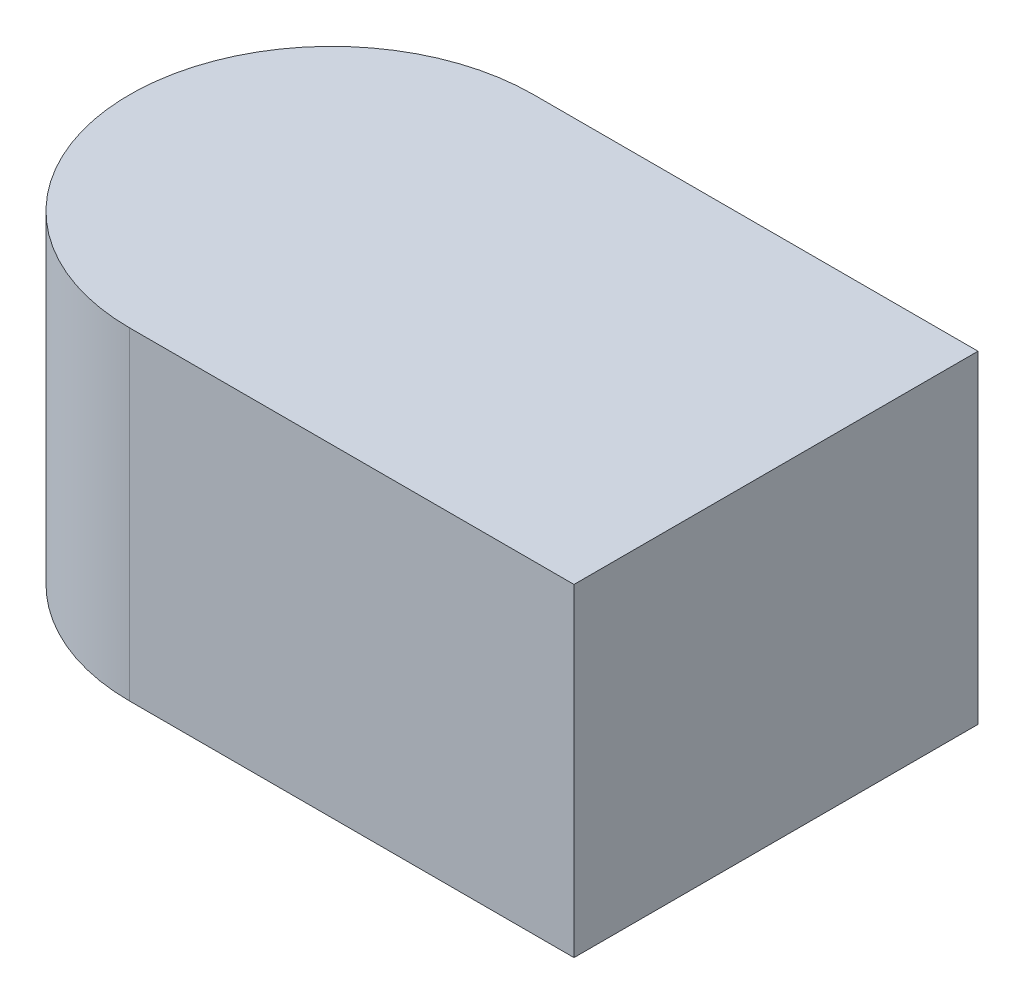
ISO-10303-21;
HEADER;
FILE_DESCRIPTION(('STEP AP214'),'2;1');
FILE_NAME('part.step','',(''),(''),'','','');
FILE_SCHEMA(('AUTOMOTIVE_DESIGN { 1 0 10303 214 1 1 1 1 }'));
ENDSEC;
DATA;
#1=APPLICATION_CONTEXT('core data for automotive mechanical design processes');
#2=APPLICATION_PROTOCOL_DEFINITION('international standard','automotive_design',2000,#1);
#3=PRODUCT_CONTEXT('',#1,'mechanical');
#4=PRODUCT('Part','Part','',(#3));
#5=PRODUCT_RELATED_PRODUCT_CATEGORY('part','',(#4));
#6=PRODUCT_DEFINITION_FORMATION('','',#4);
#7=PRODUCT_DEFINITION_CONTEXT('part definition',#1,'design');
#8=PRODUCT_DEFINITION('design','',#6,#7);
#9=PRODUCT_DEFINITION_SHAPE('','',#8);
#10=(LENGTH_UNIT() NAMED_UNIT(*) SI_UNIT(.MILLI.,.METRE.));
#11=(NAMED_UNIT(*) PLANE_ANGLE_UNIT() SI_UNIT($,.RADIAN.));
#12=(NAMED_UNIT(*) SI_UNIT($,.STERADIAN.) SOLID_ANGLE_UNIT());
#13=UNCERTAINTY_MEASURE_WITH_UNIT(LENGTH_MEASURE(1.E-05),#10,'distance_accuracy_value','');
#14=(GEOMETRIC_REPRESENTATION_CONTEXT(3) GLOBAL_UNCERTAINTY_ASSIGNED_CONTEXT((#13)) GLOBAL_UNIT_ASSIGNED_CONTEXT((#10,
#11,#12)) REPRESENTATION_CONTEXT('',''));
#15=CARTESIAN_POINT('',(0.,0.,0.));
#16=DIRECTION('',(0.,0.,1.));
#17=DIRECTION('',(1.,0.,0.));
#18=AXIS2_PLACEMENT_3D('',#15,#16,#17);
#19=CARTESIAN_POINT('',(0.,0.,0.));
#20=DIRECTION('',(0.,1.,0.));
#21=DIRECTION('',(1.,0.,0.));
#22=AXIS2_PLACEMENT_3D('',#19,#20,#21);
#23=PLANE('',#22);
#24=DIRECTION('',(0.,0.,-1.));
#25=VECTOR('',#24,1.);
#26=CARTESIAN_POINT('',(1.5,0.,0.375));
#27=LINE('',#26,#25);
#28=CARTESIAN_POINT('',(1.5,0.,0.375));
#29=VERTEX_POINT('',#28);
#30=CARTESIAN_POINT('',(1.5,0.,0.125));
#31=VERTEX_POINT('',#30);
#32=EDGE_CURVE('E11',#29,#31,#27,.T.);
#33=ORIENTED_EDGE('',*,*,#32,.F.);
#34=DIRECTION('',(1.,0.,0.));
#35=VECTOR('',#34,1.);
#36=CARTESIAN_POINT('',(1.225,0.,0.375));
#37=LINE('',#36,#35);
#38=CARTESIAN_POINT('',(1.225,0.,0.375));
#39=VERTEX_POINT('',#38);
#40=EDGE_CURVE('E24',#39,#29,#37,.T.);
#41=ORIENTED_EDGE('',*,*,#40,.F.);
#42=CARTESIAN_POINT('',(1.225,0.,0.25));
#43=DIRECTION('',(0.,1.,0.));
#44=DIRECTION('',(0.,0.,-1.));
#45=AXIS2_PLACEMENT_3D('',#42,#43,#44);
#46=CIRCLE('',#45,0.125);
#47=CARTESIAN_POINT('',(1.225,0.,0.125));
#48=VERTEX_POINT('',#47);
#49=EDGE_CURVE('E61',#48,#39,#46,.T.);
#50=ORIENTED_EDGE('',*,*,#49,.F.);
#51=DIRECTION('',(-1.,0.,0.));
#52=VECTOR('',#51,1.);
#53=CARTESIAN_POINT('',(1.5,0.,0.125));
#54=LINE('',#53,#52);
#55=EDGE_CURVE('E37',#31,#48,#54,.T.);
#56=ORIENTED_EDGE('',*,*,#55,.F.);
#57=EDGE_LOOP('',(#33,#41,#50,#56));
#58=FACE_BOUND('',#57,.T.);
#59=ADVANCED_FACE('F17',(#58),#23,.F.);
#60=CARTESIAN_POINT('',(1.5,0.,0.125));
#61=DIRECTION('',(0.,0.,-1.));
#62=DIRECTION('',(-1.,0.,0.));
#63=AXIS2_PLACEMENT_3D('',#60,#61,#62);
#64=PLANE('',#63);
#65=DIRECTION('',(0.,1.,0.));
#66=VECTOR('',#65,1.);
#67=CARTESIAN_POINT('',(1.225,0.,0.125));
#68=LINE('',#67,#66);
#69=CARTESIAN_POINT('',(1.225,0.2,0.125));
#70=VERTEX_POINT('',#69);
#71=EDGE_CURVE('E84',#48,#70,#68,.T.);
#72=ORIENTED_EDGE('',*,*,#71,.T.);
#73=DIRECTION('',(-1.,0.,0.));
#74=VECTOR('',#73,1.);
#75=CARTESIAN_POINT('',(1.5,0.2,0.125));
#76=LINE('',#75,#74);
#77=CARTESIAN_POINT('',(1.5,0.2,0.125));
#78=VERTEX_POINT('',#77);
#79=EDGE_CURVE('E74',#78,#70,#76,.T.);
#80=ORIENTED_EDGE('',*,*,#79,.F.);
#81=DIRECTION('',(0.,1.,0.));
#82=VECTOR('',#81,1.);
#83=CARTESIAN_POINT('',(1.5,0.,0.125));
#84=LINE('',#83,#82);
#85=EDGE_CURVE('E81',#31,#78,#84,.T.);
#86=ORIENTED_EDGE('',*,*,#85,.F.);
#87=ORIENTED_EDGE('',*,*,#55,.T.);
#88=EDGE_LOOP('',(#72,#80,#86,#87));
#89=FACE_BOUND('',#88,.T.);
#90=ADVANCED_FACE('F89',(#89),#64,.T.);
#91=CARTESIAN_POINT('',(1.5,0.,0.375));
#92=DIRECTION('',(1.,0.,0.));
#93=DIRECTION('',(0.,0.,-1.));
#94=AXIS2_PLACEMENT_3D('',#91,#92,#93);
#95=PLANE('',#94);
#96=ORIENTED_EDGE('',*,*,#85,.T.);
#97=DIRECTION('',(0.,0.,-1.));
#98=VECTOR('',#97,1.);
#99=CARTESIAN_POINT('',(1.5,0.2,0.375));
#100=LINE('',#99,#98);
#101=CARTESIAN_POINT('',(1.5,0.2,0.375));
#102=VERTEX_POINT('',#101);
#103=EDGE_CURVE('E79',#102,#78,#100,.T.);
#104=ORIENTED_EDGE('',*,*,#103,.F.);
#105=DIRECTION('',(0.,1.,0.));
#106=VECTOR('',#105,1.);
#107=CARTESIAN_POINT('',(1.5,0.,0.375));
#108=LINE('',#107,#106);
#109=EDGE_CURVE('E67',#29,#102,#108,.T.);
#110=ORIENTED_EDGE('',*,*,#109,.F.);
#111=ORIENTED_EDGE('',*,*,#32,.T.);
#112=EDGE_LOOP('',(#96,#104,#110,#111));
#113=FACE_BOUND('',#112,.T.);
#114=ADVANCED_FACE('F91',(#113),#95,.T.);
#115=CARTESIAN_POINT('',(1.225,0.,0.375));
#116=DIRECTION('',(0.,0.,1.));
#117=DIRECTION('',(1.,0.,0.));
#118=AXIS2_PLACEMENT_3D('',#115,#116,#117);
#119=PLANE('',#118);
#120=ORIENTED_EDGE('',*,*,#109,.T.);
#121=DIRECTION('',(1.,0.,0.));
#122=VECTOR('',#121,1.);
#123=CARTESIAN_POINT('',(1.225,0.2,0.375));
#124=LINE('',#123,#122);
#125=CARTESIAN_POINT('',(1.225,0.2,0.375));
#126=VERTEX_POINT('',#125);
#127=EDGE_CURVE('E62',#126,#102,#124,.T.);
#128=ORIENTED_EDGE('',*,*,#127,.F.);
#129=DIRECTION('',(0.,1.,0.));
#130=VECTOR('',#129,1.);
#131=CARTESIAN_POINT('',(1.225,0.,0.375));
#132=LINE('',#131,#130);
#133=EDGE_CURVE('E55',#39,#126,#132,.T.);
#134=ORIENTED_EDGE('',*,*,#133,.F.);
#135=ORIENTED_EDGE('',*,*,#40,.T.);
#136=EDGE_LOOP('',(#120,#128,#134,#135));
#137=FACE_BOUND('',#136,.T.);
#138=ADVANCED_FACE('F65',(#137),#119,.T.);
#139=CARTESIAN_POINT('',(1.225,0.,0.25));
#140=DIRECTION('',(0.,1.,0.));
#141=DIRECTION('',(1.,0.,0.));
#142=AXIS2_PLACEMENT_3D('',#139,#140,#141);
#143=CYLINDRICAL_SURFACE('',#142,0.125);
#144=ORIENTED_EDGE('',*,*,#133,.T.);
#145=CARTESIAN_POINT('',(1.225,0.2,0.25));
#146=DIRECTION('',(0.,1.,0.));
#147=DIRECTION('',(0.,0.,-1.));
#148=AXIS2_PLACEMENT_3D('',#145,#146,#147);
#149=CIRCLE('',#148,0.125);
#150=EDGE_CURVE('E60',#70,#126,#149,.T.);
#151=ORIENTED_EDGE('',*,*,#150,.F.);
#152=ORIENTED_EDGE('',*,*,#71,.F.);
#153=ORIENTED_EDGE('',*,*,#49,.T.);
#154=EDGE_LOOP('',(#144,#151,#152,#153));
#155=FACE_BOUND('',#154,.T.);
#156=ADVANCED_FACE('F57',(#155),#143,.T.);
#157=CARTESIAN_POINT('',(0.,0.2,0.));
#158=DIRECTION('',(0.,1.,0.));
#159=DIRECTION('',(1.,0.,0.));
#160=AXIS2_PLACEMENT_3D('',#157,#158,#159);
#161=PLANE('',#160);
#162=ORIENTED_EDGE('',*,*,#150,.T.);
#163=ORIENTED_EDGE('',*,*,#127,.T.);
#164=ORIENTED_EDGE('',*,*,#103,.T.);
#165=ORIENTED_EDGE('',*,*,#79,.T.);
#166=EDGE_LOOP('',(#162,#163,#164,#165));
#167=FACE_BOUND('',#166,.T.);
#168=ADVANCED_FACE('F72',(#167),#161,.T.);
#169=CLOSED_SHELL('',(#59,#90,#114,#138,#156,#168));
#170=MANIFOLD_SOLID_BREP('B1',#169);
#171=ADVANCED_BREP_SHAPE_REPRESENTATION('',(#18,#170),#14);
#172=SHAPE_DEFINITION_REPRESENTATION(#9,#171);
ENDSEC;
END-ISO-10303-21;
